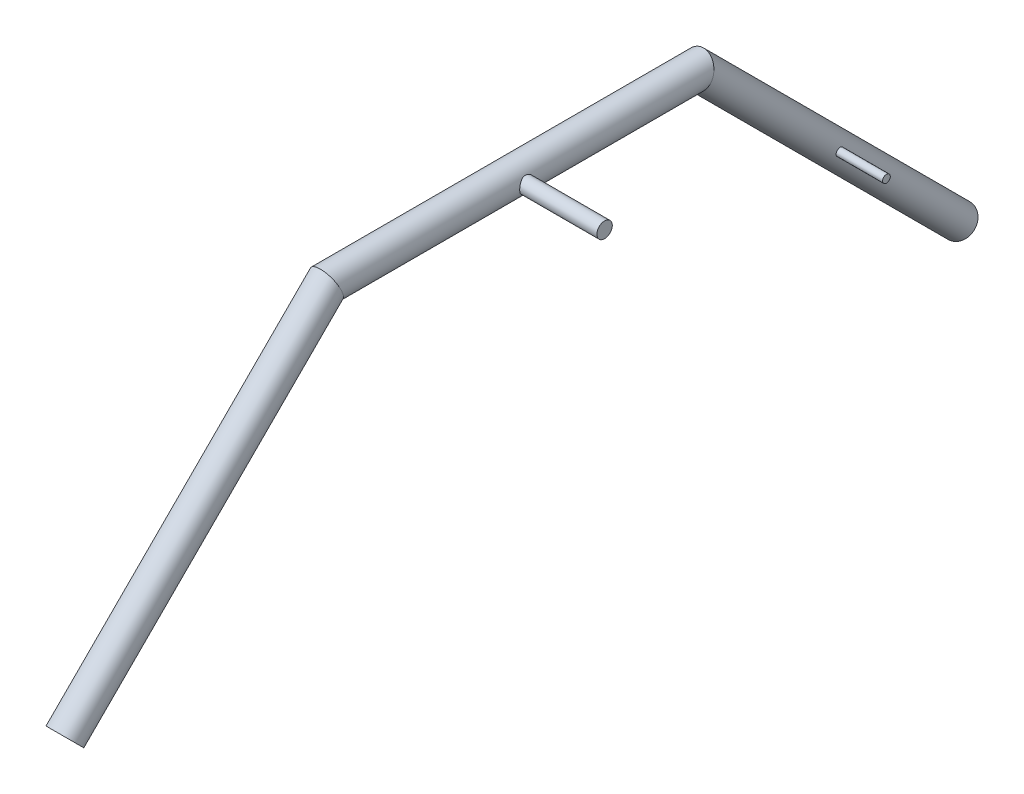
ISO-10303-21;
HEADER;
FILE_DESCRIPTION(('STEP AP214'),'2;1');
FILE_NAME('part.step','',(''),(''),'','','');
FILE_SCHEMA(('AUTOMOTIVE_DESIGN { 1 0 10303 214 1 1 1 1 }'));
ENDSEC;
DATA;
#1=APPLICATION_CONTEXT('core data for automotive mechanical design processes');
#2=APPLICATION_PROTOCOL_DEFINITION('international standard','automotive_design',2000,#1);
#3=PRODUCT_CONTEXT('',#1,'mechanical');
#4=PRODUCT('Part','Part','',(#3));
#5=PRODUCT_RELATED_PRODUCT_CATEGORY('part','',(#4));
#6=PRODUCT_DEFINITION_FORMATION('','',#4);
#7=PRODUCT_DEFINITION_CONTEXT('part definition',#1,'design');
#8=PRODUCT_DEFINITION('design','',#6,#7);
#9=PRODUCT_DEFINITION_SHAPE('','',#8);
#10=(LENGTH_UNIT() NAMED_UNIT(*) SI_UNIT(.MILLI.,.METRE.));
#11=(NAMED_UNIT(*) PLANE_ANGLE_UNIT() SI_UNIT($,.RADIAN.));
#12=(NAMED_UNIT(*) SI_UNIT($,.STERADIAN.) SOLID_ANGLE_UNIT());
#13=UNCERTAINTY_MEASURE_WITH_UNIT(LENGTH_MEASURE(1.E-05),#10,'distance_accuracy_value','');
#14=(GEOMETRIC_REPRESENTATION_CONTEXT(3) GLOBAL_UNCERTAINTY_ASSIGNED_CONTEXT((#13)) GLOBAL_UNIT_ASSIGNED_CONTEXT((#10,
#11,#12)) REPRESENTATION_CONTEXT('',''));
#15=CARTESIAN_POINT('',(0.,0.,0.));
#16=DIRECTION('',(0.,0.,1.));
#17=DIRECTION('',(1.,0.,0.));
#18=AXIS2_PLACEMENT_3D('',#15,#16,#17);
#19=CARTESIAN_POINT('',(0.,2.67264190432998,-267.981439124835));
#20=DIRECTION('',(0.,-0.707106781186549,-0.707106781186546));
#21=DIRECTION('',(0.,0.707106781186546,-0.707106781186549));
#22=AXIS2_PLACEMENT_3D('',#19,#20,#21);
#23=CYLINDRICAL_SURFACE('',#22,12.7);
#24=CARTESIAN_POINT('',(0.,-1.4897870406127,-272.143868069778));
#25=DIRECTION('',(0.,-0.382683432365091,-0.923879532511286));
#26=DIRECTION('',(0.,0.923879532511287,-0.382683432365091));
#27=AXIS2_PLACEMENT_3D('',#24,#25,#26);
#28=ELLIPSE('',#27,13.7463809437134,12.7);
#29=CARTESIAN_POINT('',(0.,11.2102129593873,-277.404380311916));
#30=VERTEX_POINT('',#29);
#31=EDGE_CURVE('E152',#30,#30,#28,.T.);
#32=ORIENTED_EDGE('',*,*,#31,.T.);
#33=EDGE_LOOP('',(#32));
#34=FACE_BOUND('',#33,.T.);
#35=CARTESIAN_POINT('',(0.,-217.015933946273,-487.670014975437));
#36=DIRECTION('',(0.,0.707106781186548,0.707106781186547));
#37=DIRECTION('',(0.,-0.707106781186547,0.707106781186548));
#38=AXIS2_PLACEMENT_3D('',#35,#36,#37);
#39=CIRCLE('',#38,12.7);
#40=CARTESIAN_POINT('',(0.,-225.996190067342,-478.689758854368));
#41=VERTEX_POINT('',#40);
#42=EDGE_CURVE('E156',#41,#41,#39,.T.);
#43=ORIENTED_EDGE('',*,*,#42,.T.);
#44=EDGE_LOOP('',(#43));
#45=FACE_BOUND('',#44,.T.);
#46=CARTESIAN_POINT('',(12.4999874999937,-106.435677825203,-373.914758854368));
#47=CARTESIAN_POINT('',(12.4774308159133,-106.613296229953,-373.914762703981));
#48=CARTESIAN_POINT('',(12.4548054258045,-106.790962337773,-373.929695563508));
#49=CARTESIAN_POINT('',(12.4119302847377,-107.141651066059,-373.989132726358));
#50=CARTESIAN_POINT('',(12.3916817169799,-107.314671341018,-374.033651685024));
#51=CARTESIAN_POINT('',(12.3558794506273,-107.651415581168,-374.151318426076));
#52=CARTESIAN_POINT('',(12.3403299572241,-107.815131113833,-374.224491717537));
#53=CARTESIAN_POINT('',(12.3158274167364,-108.128263167086,-374.397591451691));
#54=CARTESIAN_POINT('',(12.3068724243659,-108.277683893119,-374.497509993039));
#55=CARTESIAN_POINT('',(12.2967739271214,-108.554804130688,-374.718949794456));
#56=CARTESIAN_POINT('',(12.295472955332,-108.682888423618,-374.839982425864));
#57=CARTESIAN_POINT('',(12.3004186796713,-108.917229424737,-375.101456935852));
#58=CARTESIAN_POINT('',(12.3066650587202,-109.023487049691,-375.241897998824));
#59=CARTESIAN_POINT('',(12.3258140320083,-109.209891079952,-375.535970025358));
#60=CARTESIAN_POINT('',(12.3386230318437,-109.290379447298,-375.689390849644));
#61=CARTESIAN_POINT('',(12.3693832914651,-109.425261458215,-376.00681659668));
#62=CARTESIAN_POINT('',(12.3873351935626,-109.479651840064,-376.17082283949));
#63=CARTESIAN_POINT('',(12.4268424599308,-109.562001097659,-376.508713153742));
#64=CARTESIAN_POINT('',(12.4484671132642,-109.589365406622,-376.682733899038));
#65=CARTESIAN_POINT('',(12.4926700171693,-109.615016217514,-377.032798875869));
#66=CARTESIAN_POINT('',(12.5152484170445,-109.613298149812,-377.208843421055));
#67=CARTESIAN_POINT('',(12.5594573751072,-109.580413591236,-377.562561263728));
#68=CARTESIAN_POINT('',(12.5810530457171,-109.548553902453,-377.740175138209));
#69=CARTESIAN_POINT('',(12.6202947846351,-109.45508401895,-378.087861345052));
#70=CARTESIAN_POINT('',(12.6379411326156,-109.393475931848,-378.257934210748));
#71=CARTESIAN_POINT('',(12.6671416924897,-109.242786527527,-378.583979551051));
#72=CARTESIAN_POINT('',(12.6787542031537,-109.153981815589,-378.740074419834));
#73=CARTESIAN_POINT('',(12.6948273186598,-108.951137141524,-379.035305029085));
#74=CARTESIAN_POINT('',(12.6992892833412,-108.837101982238,-379.174443989455));
#75=CARTESIAN_POINT('',(12.7005362633086,-108.590537816145,-379.428058838528));
#76=CARTESIAN_POINT('',(12.6975236096849,-108.458585666366,-379.543095284858));
#77=CARTESIAN_POINT('',(12.6845760501251,-108.177825166994,-379.749822415017));
#78=CARTESIAN_POINT('',(12.6746412443862,-108.029017061416,-379.841513436742));
#79=CARTESIAN_POINT('',(12.6489601757792,-107.719275650268,-379.99889937427));
#80=CARTESIAN_POINT('',(12.633230961485,-107.558379006707,-380.064669392664));
#81=CARTESIAN_POINT('',(12.5976113919512,-107.228445854147,-380.169059883819));
#82=CARTESIAN_POINT('',(12.5777204187355,-107.05940813916,-380.20767632085));
#83=CARTESIAN_POINT('',(12.5353085283845,-106.713272917693,-380.257549872937));
#84=CARTESIAN_POINT('',(12.5127341952052,-106.536079589449,-380.268097089658));
#85=CARTESIAN_POINT('',(12.4678183886641,-106.182358861708,-380.259579118344));
#86=CARTESIAN_POINT('',(12.4454769459992,-106.005831551907,-380.240510075107));
#87=CARTESIAN_POINT('',(12.4031491923455,-105.655222239522,-380.172600304416));
#88=CARTESIAN_POINT('',(12.3832075966594,-105.48122803804,-380.123275674554));
#89=CARTESIAN_POINT('',(12.3484787951857,-105.143683592932,-379.995601365909));
#90=CARTESIAN_POINT('',(12.3336908089169,-104.980131770943,-379.917256085829));
#91=CARTESIAN_POINT('',(12.3113018784739,-104.671249752711,-379.735311759407));
#92=CARTESIAN_POINT('',(12.3035736050016,-104.525639477378,-379.632204306581));
#93=CARTESIAN_POINT('',(12.295796454121,-104.253624982652,-379.402958538851));
#94=CARTESIAN_POINT('',(12.2957462558343,-104.1272174635,-379.276824189059));
#95=CARTESIAN_POINT('',(12.3032294868332,-103.900318708096,-379.008778351293));
#96=CARTESIAN_POINT('',(12.3105706862351,-103.799251682174,-378.867347920799));
#97=CARTESIAN_POINT('',(12.3316825899819,-103.62166991453,-378.570277924103));
#98=CARTESIAN_POINT('',(12.3454536767203,-103.545156633506,-378.414637513259));
#99=CARTESIAN_POINT('',(12.377992615157,-103.418048274969,-378.09216548432));
#100=CARTESIAN_POINT('',(12.3967996657081,-103.367666042832,-377.925254104373));
#101=CARTESIAN_POINT('',(12.4372825765815,-103.294858302098,-377.585771705754));
#102=CARTESIAN_POINT('',(12.4589589395769,-103.272437699271,-377.413199699394));
#103=CARTESIAN_POINT('',(12.5035033653468,-103.255794110323,-377.061791218355));
#104=CARTESIAN_POINT('',(12.5263877748196,-103.262399132962,-376.882917132572));
#105=CARTESIAN_POINT('',(12.5702249663172,-103.305574771089,-376.528565056288));
#106=CARTESIAN_POINT('',(12.591177659424,-103.342146765209,-376.353087222413));
#107=CARTESIAN_POINT('',(12.6289432819481,-103.444731990364,-376.009388439358));
#108=CARTESIAN_POINT('',(12.6457326731422,-103.51090694344,-375.841212996652));
#109=CARTESIAN_POINT('',(12.6731107001936,-103.67106451604,-375.518126076959));
#110=CARTESIAN_POINT('',(12.6837005802602,-103.765041550129,-375.36321194383));
#111=CARTESIAN_POINT('',(12.6972882129736,-103.975487281581,-375.075031091473));
#112=CARTESIAN_POINT('',(12.7004683543248,-104.091338013789,-374.941321576355));
#113=CARTESIAN_POINT('',(12.6994193845116,-104.343605866953,-374.694986847074));
#114=CARTESIAN_POINT('',(12.6951903348188,-104.480022817271,-374.582361457992));
#115=CARTESIAN_POINT('',(12.6799229963267,-104.766988390637,-374.383075788012));
#116=CARTESIAN_POINT('',(12.6689965737807,-104.91727108577,-374.296022995164));
#117=CARTESIAN_POINT('',(12.6415986314408,-105.229529295862,-374.147703696041));
#118=CARTESIAN_POINT('',(12.6251291195718,-105.391500560096,-374.086427870393));
#119=CARTESIAN_POINT('',(12.590906834219,-105.699917140956,-373.997609737854));
#120=CARTESIAN_POINT('',(12.573643371503,-105.845427584718,-373.966583260285));
#121=CARTESIAN_POINT('',(12.5375984836211,-106.139173393799,-373.92515533715));
#122=CARTESIAN_POINT('',(12.5188169298521,-106.287408989151,-373.914755640863));
#123=CARTESIAN_POINT('',(12.4999874999937,-106.435677825203,-373.914758854368));
#124=B_SPLINE_CURVE_WITH_KNOTS('',3,(#46,#47,#48,#49,#50,#51,#52,#53,#54,#55,#56,#57,#58,#59,
#60,#61,#62,#63,#64,#65,#66,#67,#68,#69,#70,#71,#72,#73,#74,#75,#76,#77,#78,#79,#80,#81,#82,#83,
#84,#85,#86,#87,#88,#89,#90,#91,#92,#93,#94,#95,#96,#97,#98,#99,#100,#101,#102,#103,#104,#105,
#106,#107,#108,#109,#110,#111,#112,#113,#114,#115,#116,#117,#118,#119,#120,#121,#122,#123),
.UNSPECIFIED.,.T.,.F.,(4,2,2,2,2,2,2,2,2,2,2,2,2,2,2,2,2,2,2,2,2,2,2,2,2,2,2,2,2,2,2,2,2,2,2,2,
2,2,4),(0.,0.536611406915483,1.07348882027391,1.6108452709636,2.14804314541806,2.67414944959575,
3.20023365171696,3.71901559368892,4.23786235606629,4.76788501544009,5.29799095651773,
5.84059245201541,6.38315551087765,6.92037400977335,7.45749033218708,7.98022684141273,
8.50295578425222,9.02415885632173,9.54543937639686,10.0797835860516,10.6141973580594,
11.1573897372383,11.7004998176269,12.2336089588465,12.7666263878746,13.286130616937,
13.8056657455005,14.3293686945235,14.853163512467,15.3919960299147,15.9308533377725,
16.4726910908065,17.0144200625224,17.5426668407671,18.07090923634,18.5905601356185,
19.1100229991452,19.5579270453165,20.0058690749023),.UNSPECIFIED.);
#125=CARTESIAN_POINT('',(12.4999874999937,-106.435677825203,-373.914758854368));
#126=VERTEX_POINT('',#125);
#127=EDGE_CURVE('E11',#126,#126,#124,.T.);
#128=ORIENTED_EDGE('',*,*,#127,.F.);
#129=EDGE_LOOP('',(#128));
#130=FACE_BOUND('',#129,.T.);
#131=ADVANCED_FACE('F49',(#34,#45,#130),#23,.T.);
#132=CARTESIAN_POINT('',(0.,1.64971233762404,-269.004368691541));
#133=DIRECTION('',(0.,-0.707106781186549,-0.707106781186546));
#134=DIRECTION('',(0.,0.707106781186546,-0.707106781186549));
#135=AXIS2_PLACEMENT_3D('',#132,#133,#134);
#136=CYLINDRICAL_SURFACE('',#135,9.525);
#137=CARTESIAN_POINT('',(0.,-1.48978704061267,-272.143868069778));
#138=DIRECTION('',(0.,-0.382683432365091,-0.923879532511287));
#139=DIRECTION('',(0.,0.923879532511287,-0.382683432365091));
#140=AXIS2_PLACEMENT_3D('',#137,#138,#139);
#141=ELLIPSE('',#140,10.3097857077851,9.525);
#142=CARTESIAN_POINT('',(0.,8.03521295938733,-276.089252251382));
#143=VERTEX_POINT('',#142);
#144=EDGE_CURVE('E170',#143,#143,#141,.T.);
#145=ORIENTED_EDGE('',*,*,#144,.F.);
#146=EDGE_LOOP('',(#145));
#147=FACE_BOUND('',#146,.T.);
#148=CARTESIAN_POINT('',(0.,-217.015933946273,-487.670014975437));
#149=DIRECTION('',(0.,0.707106781186548,0.707106781186547));
#150=DIRECTION('',(0.,-0.707106781186547,0.707106781186548));
#151=AXIS2_PLACEMENT_3D('',#148,#149,#150);
#152=CIRCLE('',#151,9.525);
#153=CARTESIAN_POINT('',(0.,-223.751126037075,-480.934822884635));
#154=VERTEX_POINT('',#153);
#155=EDGE_CURVE('E119',#154,#154,#152,.T.);
#156=ORIENTED_EDGE('',*,*,#155,.F.);
#157=EDGE_LOOP('',(#156));
#158=FACE_BOUND('',#157,.T.);
#159=CARTESIAN_POINT('',(9.2566361330669,-106.435677825203,-373.914758854368));
#160=CARTESIAN_POINT('',(9.22625369415634,-106.61284378059,-373.914759305285));
#161=CARTESIAN_POINT('',(9.19572033423968,-106.789988041981,-373.929605975013));
#162=CARTESIAN_POINT('',(9.13769468420173,-107.139819904389,-373.988747406076));
#163=CARTESIAN_POINT('',(9.110202236732,-107.312507735644,-374.033040642901));
#164=CARTESIAN_POINT('',(9.06140624930749,-107.649197160547,-374.150400005933));
#165=CARTESIAN_POINT('',(9.04011536853919,-107.81318043571,-374.223524278751));
#166=CARTESIAN_POINT('',(9.00650350010365,-108.127143935009,-374.396863011019));
#167=CARTESIAN_POINT('',(8.9941791164519,-108.277129441899,-374.497067194442));
#168=CARTESIAN_POINT('',(8.98041886357656,-108.552983760381,-374.717494942393));
#169=CARTESIAN_POINT('',(8.97859172701316,-108.679546391399,-374.836826096324));
#170=CARTESIAN_POINT('',(8.98501157251472,-108.911380950948,-375.094381001645));
#171=CARTESIAN_POINT('',(8.99325769300374,-109.01665469944,-375.232603136373));
#172=CARTESIAN_POINT('',(9.01843466405963,-109.200572690618,-375.519937145604));
#173=CARTESIAN_POINT('',(9.03513585204407,-109.279834150475,-375.668675845768));
#174=CARTESIAN_POINT('',(9.07517195787649,-109.413655084985,-375.976032102128));
#175=CARTESIAN_POINT('',(9.09850820415607,-109.468209607286,-376.134651631634));
#176=CARTESIAN_POINT('',(9.15031653545138,-109.553255768015,-376.464140735586));
#177=CARTESIAN_POINT('',(9.1789530281446,-109.582729351716,-376.635246813805));
#178=CARTESIAN_POINT('',(9.23763706287566,-109.613484082108,-376.979758691349));
#179=CARTESIAN_POINT('',(9.26768500540163,-109.614757178108,-377.153165133248));
#180=CARTESIAN_POINT('',(9.32738328170894,-109.588482929504,-377.505721902996));
#181=CARTESIAN_POINT('',(9.35695918831099,-109.559676866828,-377.68479311411));
#182=CARTESIAN_POINT('',(9.41100757487288,-109.471751060213,-378.036155601749));
#183=CARTESIAN_POINT('',(9.43548062122286,-109.41263468308,-378.208447629002));
#184=CARTESIAN_POINT('',(9.4762346909668,-109.266492924834,-378.538616204564));
#185=CARTESIAN_POINT('',(9.49263658046103,-109.179913413465,-378.696674517982));
#186=CARTESIAN_POINT('',(9.51592728965883,-108.980866005526,-378.996316716221));
#187=CARTESIAN_POINT('',(9.52281941077462,-108.868407109073,-379.137906302687));
#188=CARTESIAN_POINT('',(9.52621404080112,-108.626843590776,-379.393871083991));
#189=CARTESIAN_POINT('',(9.52318768499377,-108.498764292014,-379.50920979264));
#190=CARTESIAN_POINT('',(9.50810220302706,-108.226002959164,-379.717457511193));
#191=CARTESIAN_POINT('',(9.49604339598474,-108.081321511784,-379.810367313357));
#192=CARTESIAN_POINT('',(9.46429029941504,-107.78078912834,-379.970747151693));
#193=CARTESIAN_POINT('',(9.44465727857003,-107.625035797494,-380.038412963128));
#194=CARTESIAN_POINT('',(9.39971630082359,-107.305495122311,-380.147958932001));
#195=CARTESIAN_POINT('',(9.37440714306365,-107.141706083655,-380.189833625969));
#196=CARTESIAN_POINT('',(9.31944891535626,-106.803212182266,-380.248279117799));
#197=CARTESIAN_POINT('',(9.28966353110439,-106.628336156844,-380.263730295827));
#198=CARTESIAN_POINT('',(9.2296853964353,-106.278458578545,-380.265688520709));
#199=CARTESIAN_POINT('',(9.19949253351738,-106.103457004177,-380.252187404676));
#200=CARTESIAN_POINT('',(9.14094922313878,-105.751741852399,-380.195500635445));
#201=CARTESIAN_POINT('',(9.11269506755115,-105.575169101156,-380.151330594112));
#202=CARTESIAN_POINT('',(9.06262096386527,-105.231354061251,-380.033099004666));
#203=CARTESIAN_POINT('',(9.04079941147191,-105.064109454594,-379.959044920583));
#204=CARTESIAN_POINT('',(9.00691150550902,-104.748456667348,-379.785212852438));
#205=CARTESIAN_POINT('',(8.99459459600127,-104.59965832921,-379.686194069437));
#206=CARTESIAN_POINT('',(8.98038798575557,-104.320516936098,-379.464306799775));
#207=CARTESIAN_POINT('',(8.97849456371158,-104.190167310914,-379.341446840909));
#208=CARTESIAN_POINT('',(8.98520921048567,-103.957943945014,-379.082306598006));
#209=CARTESIAN_POINT('',(8.99330663739838,-103.854986919848,-378.946980414889));
#210=CARTESIAN_POINT('',(9.01814885463917,-103.672240980367,-378.662230952276));
#211=CARTESIAN_POINT('',(9.03489440701275,-103.592454108699,-378.512806431428));
#212=CARTESIAN_POINT('',(9.07526055630374,-103.457278649707,-378.202694142633));
#213=CARTESIAN_POINT('',(9.09893777673245,-103.402100851278,-378.041922234196));
#214=CARTESIAN_POINT('',(9.15052321023592,-103.318111823733,-377.714281906877));
#215=CARTESIAN_POINT('',(9.17843260141573,-103.289307952063,-377.547411800294));
#216=CARTESIAN_POINT('',(9.23712924641286,-103.257725373884,-377.202653105114));
#217=CARTESIAN_POINT('',(9.26799067469422,-103.25638472164,-377.024644278913));
#218=CARTESIAN_POINT('',(9.32791319370628,-103.28346661224,-376.670566614777));
#219=CARTESIAN_POINT('',(9.35697401890834,-103.311893533792,-376.4944980661));
#220=CARTESIAN_POINT('',(9.41063805834846,-103.398812636844,-376.145894307926));
#221=CARTESIAN_POINT('',(9.43515626572202,-103.457812137323,-375.973471500914));
#222=CARTESIAN_POINT('',(9.47631220734737,-103.604890141072,-375.640496360179));
#223=CARTESIAN_POINT('',(9.49295247714385,-103.692959272659,-375.479940221181));
#224=CARTESIAN_POINT('',(9.51593377173127,-103.891719124677,-375.181965079926));
#225=CARTESIAN_POINT('',(9.52266102222905,-104.001361157316,-375.043876473016));
#226=CARTESIAN_POINT('',(9.52631007171409,-104.242049057937,-374.787696772458));
#227=CARTESIAN_POINT('',(9.52323405736289,-104.373090146579,-374.669601225459));
#228=CARTESIAN_POINT('',(9.50789631937358,-104.647746071033,-374.460556665555));
#229=CARTESIAN_POINT('',(9.49595034227166,-104.790782198237,-374.368821440157));
#230=CARTESIAN_POINT('',(9.46447276281759,-105.088971496396,-374.209551944207));
#231=CARTESIAN_POINT('',(9.44493984209636,-105.244126769526,-374.142021883665));
#232=CARTESIAN_POINT('',(9.39921908273319,-105.569585090413,-374.030112081064));
#233=CARTESIAN_POINT('',(9.37277171898518,-105.740255502865,-373.986908512978));
#234=CARTESIAN_POINT('',(9.31647797763818,-106.085849440986,-373.92922744373));
#235=CARTESIAN_POINT('',(9.28663060096233,-106.260774204837,-373.914758409209));
#236=CARTESIAN_POINT('',(9.2566361330669,-106.435677825203,-373.914758854368));
#237=B_SPLINE_CURVE_WITH_KNOTS('',3,(#159,#160,#161,#162,#163,#164,#165,#166,#167,#168,#169,
#170,#171,#172,#173,#174,#175,#176,#177,#178,#179,#180,#181,#182,#183,#184,#185,#186,#187,#188,
#189,#190,#191,#192,#193,#194,#195,#196,#197,#198,#199,#200,#201,#202,#203,#204,#205,#206,#207,
#208,#209,#210,#211,#212,#213,#214,#215,#216,#217,#218,#219,#220,#221,#222,#223,#224,#225,#226,
#227,#228,#229,#230,#231,#232,#233,#234,#235,#236),.UNSPECIFIED.,.T.,.F.,(4,2,2,2,2,2,2,2,2,2,2,
2,2,2,2,2,2,2,2,2,2,2,2,2,2,2,2,2,2,2,2,2,2,2,2,2,2,2,4),(0.,0.538651476051014,1.07727506716325,
1.61699056045342,2.15650153452772,2.67576572854465,3.19498551247615,3.70080329366502,
4.20672241805657,4.73231207509727,5.2580517758203,5.80670876214739,6.35530481803369,
6.89541465249098,7.43533693514239,7.94999103060345,8.46462694416151,8.97518436003212,
9.48584989284192,10.0176617174191,10.549623502155,11.0995004252561,11.6492400924688,
12.1839396112628,12.7184482237352,13.2267340504142,13.7350646732784,14.2476694907144,
14.76041726427,15.2999490983347,15.839560306835,16.3884269747644,16.9371168675341,
17.463805293109,17.9903762467274,18.4990507072891,19.0078135988387,19.5394301034358,
20.071203225824),.UNSPECIFIED.);
#238=CARTESIAN_POINT('',(9.2566361330669,-106.435677825203,-373.914758854368));
#239=VERTEX_POINT('',#238);
#240=EDGE_CURVE('E53',#239,#239,#237,.T.);
#241=ORIENTED_EDGE('',*,*,#240,.T.);
#242=EDGE_LOOP('',(#241));
#243=FACE_BOUND('',#242,.T.);
#244=ADVANCED_FACE('F105',(#147,#158,#243),#136,.F.);
#245=CARTESIAN_POINT('',(0.,-1.4897870406127,38.5426953965743));
#246=DIRECTION('',(0.,0.,-1.));
#247=DIRECTION('',(-1.,0.,0.));
#248=AXIS2_PLACEMENT_3D('',#245,#246,#247);
#249=CYLINDRICAL_SURFACE('',#248,12.7);
#250=CARTESIAN_POINT('',(0.,-1.4897870406127,32.6561319302221));
#251=DIRECTION('',(0.,0.382683432365091,-0.923879532511286));
#252=DIRECTION('',(0.,0.923879532511286,0.382683432365091));
#253=AXIS2_PLACEMENT_3D('',#250,#251,#252);
#254=ELLIPSE('',#253,13.7463809437134,12.7);
#255=CARTESIAN_POINT('',(0.,11.2102129593873,37.9166441723604));
#256=VERTEX_POINT('',#255);
#257=EDGE_CURVE('E67',#256,#256,#254,.T.);
#258=ORIENTED_EDGE('',*,*,#257,.T.);
#259=EDGE_LOOP('',(#258));
#260=FACE_BOUND('',#259,.T.);
#261=ORIENTED_EDGE('',*,*,#31,.F.);
#262=EDGE_LOOP('',(#261));
#263=FACE_BOUND('',#262,.T.);
#264=CARTESIAN_POINT('',(12.7,-1.4897870406127,-113.393868069778));
#265=CARTESIAN_POINT('',(12.6999994891774,-1.65677791980761,-113.393868627602));
#266=CARTESIAN_POINT('',(12.6966986728259,-1.82378049081133,-113.400462898579));
#267=CARTESIAN_POINT('',(12.6835786203218,-2.15655556725274,-113.42676474111));
#268=CARTESIAN_POINT('',(12.6737565484519,-2.32232750583582,-113.44647801737));
#269=CARTESIAN_POINT('',(12.6478292478082,-2.65156171789673,-113.498821868467));
#270=CARTESIAN_POINT('',(12.6317150589571,-2.81502035168104,-113.531470864958));
#271=CARTESIAN_POINT('',(12.5936085062318,-3.13828052309058,-113.609324399755));
#272=CARTESIAN_POINT('',(12.5716137398496,-3.29808053695416,-113.654534070016));
#273=CARTESIAN_POINT('',(12.5223959142721,-3.61222884940147,-113.756806889449));
#274=CARTESIAN_POINT('',(12.4951959650805,-3.76659780219676,-113.813817731834));
#275=CARTESIAN_POINT('',(12.436150269919,-4.06972158298842,-113.939267791719));
#276=CARTESIAN_POINT('',(12.4043027843762,-4.2184742824637,-114.007711289855));
#277=CARTESIAN_POINT('',(12.302881193969,-4.65491516254916,-114.229276396264));
#278=CARTESIAN_POINT('',(12.2273713354024,-4.93313208018793,-114.398746428739));
#279=CARTESIAN_POINT('',(12.0622186773861,-5.47450500182983,-114.787810575792));
#280=CARTESIAN_POINT('',(11.9719972312188,-5.73573158675631,-115.009816827984));
#281=CARTESIAN_POINT('',(11.7893960148839,-6.21915257216465,-115.492719878581));
#282=CARTESIAN_POINT('',(11.6970146601478,-6.44131722841707,-115.753646036034));
#283=CARTESIAN_POINT('',(11.5603243398217,-6.74934102839498,-116.181043203069));
#284=CARTESIAN_POINT('',(11.5134721485475,-6.85084974552579,-116.335664176016));
#285=CARTESIAN_POINT('',(11.4233099497228,-7.04037072821734,-116.653920454303));
#286=CARTESIAN_POINT('',(11.3799984680683,-7.12838862390478,-116.817551960308));
#287=CARTESIAN_POINT('',(11.2984098057888,-7.2901451235037,-117.152920205373));
#288=CARTESIAN_POINT('',(11.2601322945723,-7.36388466525522,-117.324656411172));
#289=CARTESIAN_POINT('',(11.1900882100937,-7.49624492897789,-117.675051126578));
#290=CARTESIAN_POINT('',(11.1583177917589,-7.55487458477507,-117.85370547357));
#291=CARTESIAN_POINT('',(11.104259497995,-7.65325884822883,-118.205844278748));
#292=CARTESIAN_POINT('',(11.08151961136,-7.69392953173717,-118.379003087267));
#293=CARTESIAN_POINT('',(11.0438804844397,-7.76068645741718,-118.728957979682));
#294=CARTESIAN_POINT('',(11.0289809087597,-7.78677332346183,-118.905753907653));
#295=CARTESIAN_POINT('',(11.0076763086804,-7.82394237980647,-119.261277364542));
#296=CARTESIAN_POINT('',(11.0012640993806,-7.83503726159646,-119.440003130374));
#297=CARTESIAN_POINT('',(10.9972004886715,-7.84207814818819,-119.797844612084));
#298=CARTESIAN_POINT('',(10.9995482514047,-7.83802559832464,-119.976960289129));
#299=CARTESIAN_POINT('',(11.012090292946,-7.81623881197733,-120.312450371653));
#300=CARTESIAN_POINT('',(11.0213095833287,-7.80020403536759,-120.468975429648));
#301=CARTESIAN_POINT('',(11.046128374712,-7.7566583855275,-120.779958604436));
#302=CARTESIAN_POINT('',(11.0617299789813,-7.72914372908407,-120.934416022499));
#303=CARTESIAN_POINT('',(11.0988027904553,-7.66295577509789,-121.24017936648));
#304=CARTESIAN_POINT('',(11.120273227066,-7.62428394248658,-121.391485703337));
#305=CARTESIAN_POINT('',(11.1684190383084,-7.53618489638032,-121.690106711781));
#306=CARTESIAN_POINT('',(11.1950964580098,-7.48675345611197,-121.83741978902));
#307=CARTESIAN_POINT('',(11.2831376118079,-7.32046703973683,-122.278796796713));
#308=CARTESIAN_POINT('',(11.351625656313,-7.18711862051005,-122.565418631972));
#309=CARTESIAN_POINT('',(11.500071400071,-6.88118584643924,-123.113444919895));
#310=CARTESIAN_POINT('',(11.5800342452273,-6.7085838678192,-123.374837970208));
#311=CARTESIAN_POINT('',(11.7546812882032,-6.30352420368694,-123.900055500737));
#312=CARTESIAN_POINT('',(11.8499465086129,-6.06625199945793,-124.159985740129));
#313=CARTESIAN_POINT('',(12.0362854764244,-5.5509097911418,-124.63807147064));
#314=CARTESIAN_POINT('',(12.1273572049436,-5.27282040062726,-124.856206996919));
#315=CARTESIAN_POINT('',(12.255938857257,-4.82265347800967,-125.152089444295));
#316=CARTESIAN_POINT('',(12.2983050254296,-4.66314426671061,-125.2472279165));
#317=CARTESIAN_POINT('',(12.3782218301755,-4.33548475687708,-125.423574781022));
#318=CARTESIAN_POINT('',(12.4157746297482,-4.16733838757132,-125.504789435907));
#319=CARTESIAN_POINT('',(12.4849579292559,-3.82357464405201,-125.652414640885));
#320=CARTESIAN_POINT('',(12.5165907293456,-3.64796020416409,-125.718830942643));
#321=CARTESIAN_POINT('',(12.5729876360055,-3.29053512580538,-125.83608972976));
#322=CARTESIAN_POINT('',(12.5977525327026,-3.10872520280673,-125.886934006693));
#323=CARTESIAN_POINT('',(12.6378915597613,-2.755723395467,-125.968815029523));
#324=CARTESIAN_POINT('',(12.6538736459652,-2.58489947760057,-126.001143656087));
#325=CARTESIAN_POINT('',(12.6789562420375,-2.24067835946114,-126.051713658141));
#326=CARTESIAN_POINT('',(12.6880571262137,-2.06728129967925,-126.069955799878));
#327=CARTESIAN_POINT('',(12.6991158370576,-1.71941665198612,-126.092106793677));
#328=CARTESIAN_POINT('',(12.7010765197081,-1.54494952006627,-126.096021376571));
#329=CARTESIAN_POINT('',(12.6978059034872,-1.19635653319513,-126.089479461829));
#330=CARTESIAN_POINT('',(12.6925749229034,-1.02223066348186,-126.079023600198));
#331=CARTESIAN_POINT('',(12.6757555094506,-0.689277503868629,-126.045254438257));
#332=CARTESIAN_POINT('',(12.6646934781011,-0.530314153448554,-126.023004995776));
#333=CARTESIAN_POINT('',(12.6368459564446,-0.214958640091404,-125.966646907296));
#334=CARTESIAN_POINT('',(12.6200585231077,-0.0585673689527108,-125.932534235195));
#335=CARTESIAN_POINT('',(12.581159973299,0.250520728027685,-125.852820116819));
#336=CARTESIAN_POINT('',(12.5590505630802,0.403218720721145,-125.807222352506));
#337=CARTESIAN_POINT('',(12.5099971792976,0.704118660112634,-125.704953678719));
#338=CARTESIAN_POINT('',(12.4830513245292,0.852318831001327,-125.648278459746));
#339=CARTESIAN_POINT('',(12.4240951779885,1.1474715217762,-125.522605775806));
#340=CARTESIAN_POINT('',(12.3919635638501,1.29427118289351,-125.453306064681));
#341=CARTESIAN_POINT('',(12.32392525103,1.58148052651925,-125.3040866757));
#342=CARTESIAN_POINT('',(12.2880172735192,1.72188802116851,-125.224163397842));
#343=CARTESIAN_POINT('',(12.1757741292216,2.13248672384417,-124.969318956096));
#344=CARTESIAN_POINT('',(12.0948877082824,2.39220836067138,-124.77925699099));
#345=CARTESIAN_POINT('',(11.9194499483036,2.90301290089874,-124.342728225611));
#346=CARTESIAN_POINT('',(11.8243367236915,3.1507428631143,-124.092555264645));
#347=CARTESIAN_POINT('',(11.6839772811164,3.48913691378379,-123.688957979926));
#348=CARTESIAN_POINT('',(11.6375432562751,3.59646676191905,-123.549591964638));
#349=CARTESIAN_POINT('',(11.5466734049483,3.79951204817738,-123.261934327099));
#350=CARTESIAN_POINT('',(11.5022378780468,3.89522574861524,-123.1136413744));
#351=CARTESIAN_POINT('',(11.4145838039713,4.07870685010253,-122.801439969167));
#352=CARTESIAN_POINT('',(11.3715304916549,4.16585845529205,-122.637122625727));
#353=CARTESIAN_POINT('',(11.290579644901,4.3257820531541,-122.300497535878));
#354=CARTESIAN_POINT('',(11.2526796279935,4.39856097720213,-122.128193690789));
#355=CARTESIAN_POINT('',(11.1834979926119,4.52891889153224,-121.776788905619));
#356=CARTESIAN_POINT('',(11.1522110654535,4.58651008309703,-121.597693554719));
#357=CARTESIAN_POINT('',(11.0975495796607,4.68577900994958,-121.233969731758));
#358=CARTESIAN_POINT('',(11.0741737959829,4.72745920918875,-121.049342121194));
#359=CARTESIAN_POINT('',(11.038221566145,4.79104599178573,-120.694129811253));
#360=CARTESIAN_POINT('',(11.0248238589961,4.81446663513222,-120.523898370593));
#361=CARTESIAN_POINT('',(11.0059068618669,4.84743482684167,-120.181662096087));
#362=CARTESIAN_POINT('',(11.0003870360907,4.85698331868744,-120.009657383646));
#363=CARTESIAN_POINT('',(10.9974561088362,4.86206051588589,-119.665436786344));
#364=CARTESIAN_POINT('',(11.0000420081603,4.85759440677727,-119.493221003152));
#365=CARTESIAN_POINT('',(11.0132073594892,4.83472372634817,-119.150034403732));
#366=CARTESIAN_POINT('',(11.023786484255,4.8163197256387,-118.979063536827));
#367=CARTESIAN_POINT('',(11.0511312712702,4.76826216657192,-118.656038379882));
#368=CARTESIAN_POINT('',(11.0672085028909,4.73985282658711,-118.503738751757));
#369=CARTESIAN_POINT('',(11.1050268373618,4.67218235062066,-118.20226770911));
#370=CARTESIAN_POINT('',(11.1267698205995,4.63291761161248,-118.053097350945));
#371=CARTESIAN_POINT('',(11.1995485940621,4.49941051488456,-117.61164373819));
#372=CARTESIAN_POINT('',(11.2581531108883,4.38942391610102,-117.325211050686));
#373=CARTESIAN_POINT('',(11.3937155944897,4.12243005274277,-116.755352064246));
#374=CARTESIAN_POINT('',(11.4716421113511,3.962760152483,-116.473420672326));
#375=CARTESIAN_POINT('',(11.635439817654,3.60388616889509,-115.938494996407));
#376=CARTESIAN_POINT('',(11.7213151279082,3.40466151762678,-115.685515875545));
#377=CARTESIAN_POINT('',(11.9038699110716,2.94375331211603,-115.18362981464));
#378=CARTESIAN_POINT('',(12.0005943076297,2.67742190853151,-114.938952637043));
#379=CARTESIAN_POINT('',(12.1383310810892,2.24834930257089,-114.607562019804));
#380=CARTESIAN_POINT('',(12.1830529217553,2.10025865671271,-114.502962977824));
#381=CARTESIAN_POINT('',(12.2688872478125,1.7949488582359,-114.306412892178));
#382=CARTESIAN_POINT('',(12.3100013738234,1.63773390953138,-114.214456088518));
#383=CARTESIAN_POINT('',(12.3878055405892,1.31382473336567,-114.043334961263));
#384=CARTESIAN_POINT('',(12.4244591999769,1.14706700677187,-113.964274249818));
#385=CARTESIAN_POINT('',(12.4919115290982,0.806356957012716,-113.82066178436));
#386=CARTESIAN_POINT('',(12.5227130740716,0.632408218327429,-113.756102902501));
#387=CARTESIAN_POINT('',(12.5775008101552,0.278938300784715,-113.642351329438));
#388=CARTESIAN_POINT('',(12.6015018553988,0.0994302321593499,-113.593125123776));
#389=CARTESIAN_POINT('',(12.642019952057,-0.263936499781345,-113.510532800744));
#390=CARTESIAN_POINT('',(12.6585415748002,-0.447792433229217,-113.477156995197));
#391=CARTESIAN_POINT('',(12.6806500718221,-0.774724011958794,-113.432635507854));
#392=CARTESIAN_POINT('',(12.6878936037074,-0.917238227961638,-113.41811016793));
#393=CARTESIAN_POINT('',(12.6975688534566,-1.20309442242374,-113.398726076059));
#394=CARTESIAN_POINT('',(12.7000004385074,-1.34643642362093,-113.393867590923));
#395=CARTESIAN_POINT('',(12.7,-1.4897870406127,-113.393868069778));
#396=B_SPLINE_CURVE_WITH_KNOTS('',3,(#264,#265,#266,#267,#268,#269,#270,#271,#272,#273,#274,
#275,#276,#277,#278,#279,#280,#281,#282,#283,#284,#285,#286,#287,#288,#289,#290,#291,#292,#293,
#294,#295,#296,#297,#298,#299,#300,#301,#302,#303,#304,#305,#306,#307,#308,#309,#310,#311,#312,
#313,#314,#315,#316,#317,#318,#319,#320,#321,#322,#323,#324,#325,#326,#327,#328,#329,#330,#331,
#332,#333,#334,#335,#336,#337,#338,#339,#340,#341,#342,#343,#344,#345,#346,#347,#348,#349,#350,
#351,#352,#353,#354,#355,#356,#357,#358,#359,#360,#361,#362,#363,#364,#365,#366,#367,#368,#369,
#370,#371,#372,#373,#374,#375,#376,#377,#378,#379,#380,#381,#382,#383,#384,#385,#386,#387,#388,
#389,#390,#391,#392,#393,#394,#395),.UNSPECIFIED.,.T.,.F.,(4,2,2,2,2,2,2,2,2,2,2,2,2,2,2,2,2,2,
2,2,2,2,2,2,2,2,2,2,2,2,2,2,2,2,2,2,2,2,2,2,2,2,2,2,2,2,2,2,2,2,2,2,2,2,2,2,2,2,2,2,2,2,2,2,2,
4),(0.,0.500831224205358,1.00188037372803,1.50364564290689,2.00561622220709,2.50540779268628,
3.0053869172507,4.00425210956755,5.06354639773445,6.12364383897771,6.69546056113471,
7.26703799333406,7.83857787007115,8.40977904053157,8.94696617231633,9.48413032231424,
10.020839449589,10.5574973665628,11.0297819407841,11.5022222802448,11.9746006167424,
12.447164856978,13.4133450583963,14.3799599077214,15.4691385823986,16.558836254714,
17.1296896955319,17.7002857039293,18.2706595507725,18.840967750957,19.3640345307036,
19.8870728558157,20.4099019497636,20.9327079051584,21.4148301207384,21.8971161172382,
22.3792476958437,22.8615672144633,23.3574791185916,23.8535595025871,24.845213267335,
25.9342484207188,26.4795520760264,27.0249372042285,27.5969396508644,28.1686655660688,
28.7399307681393,29.3111074690516,29.8274552059118,30.3437678229116,30.8598894217494,
31.3759898919437,31.8427315926275,32.3096283963947,33.2427989036526,34.2386648311406,
35.2350499582129,36.3525027406484,36.9121724680044,37.4715863502977,38.0352942497766,
38.5987244700202,39.1609143479984,39.7227601571806,40.1526787482413,40.5826092051903),.UNSPECIFIED.);
#397=CARTESIAN_POINT('',(12.7,-1.4897870406127,-113.393868069778));
#398=VERTEX_POINT('',#397);
#399=EDGE_CURVE('E62',#398,#398,#396,.T.);
#400=ORIENTED_EDGE('',*,*,#399,.F.);
#401=EDGE_LOOP('',(#400));
#402=FACE_BOUND('',#401,.T.);
#403=ADVANCED_FACE('F121',(#260,#263,#402),#249,.T.);
#404=CARTESIAN_POINT('',(0.,-1.48978704061267,37.0960545299863));
#405=DIRECTION('',(0.,0.,-1.));
#406=DIRECTION('',(-1.,0.,0.));
#407=AXIS2_PLACEMENT_3D('',#404,#405,#406);
#408=CYLINDRICAL_SURFACE('',#407,9.525);
#409=ORIENTED_EDGE('',*,*,#144,.T.);
#410=EDGE_LOOP('',(#409));
#411=FACE_BOUND('',#410,.T.);
#412=CARTESIAN_POINT('',(0.,-1.48978704061256,32.6561319302221));
#413=DIRECTION('',(0.,0.382683432365091,-0.923879532511287));
#414=DIRECTION('',(0.,0.923879532511287,0.382683432365091));
#415=AXIS2_PLACEMENT_3D('',#412,#413,#414);
#416=ELLIPSE('',#415,10.3097857077851,9.525);
#417=CARTESIAN_POINT('',(0.,8.03521295938744,36.6015161118259));
#418=VERTEX_POINT('',#417);
#419=EDGE_CURVE('E162',#418,#418,#416,.T.);
#420=ORIENTED_EDGE('',*,*,#419,.F.);
#421=EDGE_LOOP('',(#420));
#422=FACE_BOUND('',#421,.T.);
#423=CARTESIAN_POINT('',(9.52500000000001,-1.4897870406127,-113.393868069778));
#424=CARTESIAN_POINT('',(9.52499995302127,-1.64930922529285,-113.393868116678));
#425=CARTESIAN_POINT('',(9.52098401348312,-1.80883221666415,-113.399887291772));
#426=CARTESIAN_POINT('',(9.50502147249805,-2.12657409223065,-113.423869032869));
#427=CARTESIAN_POINT('',(9.49307482930957,-2.28479296955748,-113.441831661733));
#428=CARTESIAN_POINT('',(9.46153969282097,-2.59874758910036,-113.489435560633));
#429=CARTESIAN_POINT('',(9.44194822064128,-2.75448233870052,-113.519081383179));
#430=CARTESIAN_POINT('',(9.39559036683439,-3.06228048590965,-113.589625713896));
#431=CARTESIAN_POINT('',(9.36882389844983,-3.21434383910125,-113.630524358131));
#432=CARTESIAN_POINT('',(9.30886537420495,-3.51308617199159,-113.722815357228));
#433=CARTESIAN_POINT('',(9.2757059421349,-3.65978817181756,-113.774154503377));
#434=CARTESIAN_POINT('',(9.2035713113691,-3.94783217303828,-113.886866631401));
#435=CARTESIAN_POINT('',(9.1645938472794,-4.08917205955641,-113.948243522615));
#436=CARTESIAN_POINT('',(9.04008640647303,-4.50402258574737,-114.146486048555));
#437=CARTESIAN_POINT('',(8.94692755885441,-4.76862219208656,-114.297544537793));
#438=CARTESIAN_POINT('',(8.73846290686175,-5.29120746012685,-114.646915476657));
#439=CARTESIAN_POINT('',(8.62194858766981,-5.54672657395838,-114.84815002851));
#440=CARTESIAN_POINT('',(8.38142132332393,-6.02283653690501,-115.285331001584));
#441=CARTESIAN_POINT('',(8.25739778727135,-6.24337638777616,-115.52132715493));
#442=CARTESIAN_POINT('',(8.06347927572664,-6.56173796199019,-115.918602359765));
#443=CARTESIAN_POINT('',(7.99276165906505,-6.67215605585161,-116.06954997759));
#444=CARTESIAN_POINT('',(7.85423181855953,-6.87980175525613,-116.381517753631));
#445=CARTESIAN_POINT('',(7.78642025681812,-6.9770263656721,-116.542540186906));
#446=CARTESIAN_POINT('',(7.59098753954933,-7.24754365030399,-117.039668971679));
#447=CARTESIAN_POINT('',(7.47095386772018,-7.40032724740184,-117.39063937361));
#448=CARTESIAN_POINT('',(7.30173884021222,-7.60720858103283,-118.019018551067));
#449=CARTESIAN_POINT('',(7.24210690604665,-7.67706306488747,-118.288408303811));
#450=CARTESIAN_POINT('',(7.17443610973183,-7.75510524308877,-118.700845704673));
#451=CARTESIAN_POINT('',(7.15551189712762,-7.77665944849341,-118.839660113549));
#452=CARTESIAN_POINT('',(7.1255840953054,-7.81056299642999,-119.119284759294));
#453=CARTESIAN_POINT('',(7.11458054949506,-7.82291228851621,-119.260095007098));
#454=CARTESIAN_POINT('',(7.10093685388961,-7.83820605740571,-119.543217701081));
#455=CARTESIAN_POINT('',(7.09833152574747,-7.84111137694439,-119.685533953271));
#456=CARTESIAN_POINT('',(7.10169083317634,-7.83735497956311,-119.969937038923));
#457=CARTESIAN_POINT('',(7.10765549785802,-7.83069323014559,-120.112023871604));
#458=CARTESIAN_POINT('',(7.12790820220153,-7.80791818180331,-120.394914829016));
#459=CARTESIAN_POINT('',(7.14220075299526,-7.7917997602619,-120.5357182165));
#460=CARTESIAN_POINT('',(7.17852290817034,-7.75039243299932,-120.814979596537));
#461=CARTESIAN_POINT('',(7.20055576995174,-7.72509966623925,-120.953436575882));
#462=CARTESIAN_POINT('',(7.27478957681072,-7.63866607320999,-121.351731969154));
#463=CARTESIAN_POINT('',(7.33620201701265,-7.5658444005062,-121.607423262154));
#464=CARTESIAN_POINT('',(7.47743075866494,-7.39115778214636,-122.10301535485));
#465=CARTESIAN_POINT('',(7.55725311438592,-7.2892832795868,-122.34291092654));
#466=CARTESIAN_POINT('',(7.74586039676384,-7.03568875038075,-122.852250602729));
#467=CARTESIAN_POINT('',(7.85723391455877,-6.87804480236335,-123.117779629039));
#468=CARTESIAN_POINT('',(8.08646851184115,-6.52749939970247,-123.621794016285));
#469=CARTESIAN_POINT('',(8.20433746619289,-6.33455445952359,-123.860245427949));
#470=CARTESIAN_POINT('',(8.39189544489691,-5.99789459699153,-124.219821344461));
#471=CARTESIAN_POINT('',(8.46237649743462,-5.8644893271291,-124.350324467896));
#472=CARTESIAN_POINT('',(8.60065671785608,-5.58594052619248,-124.599684257906));
#473=CARTESIAN_POINT('',(8.66845667843422,-5.4408005038558,-124.718544382447));
#474=CARTESIAN_POINT('',(8.7996219217699,-5.13934790005115,-124.943732042199));
#475=CARTESIAN_POINT('',(8.86298939243476,-4.98304090880162,-125.05006577851));
#476=CARTESIAN_POINT('',(8.98365184167378,-4.65985791864928,-125.249243019022));
#477=CARTESIAN_POINT('',(9.04094848992311,-4.49298484604233,-125.342090235078));
#478=CARTESIAN_POINT('',(9.13738661743715,-4.18324340658336,-125.496396618687));
#479=CARTESIAN_POINT('',(9.17788544551756,-4.04208029265907,-125.560441075967));
#480=CARTESIAN_POINT('',(9.25313321006477,-3.7541369477202,-125.67846303454));
#481=CARTESIAN_POINT('',(9.28788331086878,-3.60735786158829,-125.732442574646));
#482=CARTESIAN_POINT('',(9.35089181550515,-3.30903750175028,-125.829706105766));
#483=CARTESIAN_POINT('',(9.37915430201628,-3.15749929162123,-125.872996824598));
#484=CARTESIAN_POINT('',(9.42858494827341,-2.85051403995657,-125.948374452535));
#485=CARTESIAN_POINT('',(9.44975299888663,-2.69506693833053,-125.980461189292));
#486=CARTESIAN_POINT('',(9.48456888164441,-2.38068351270774,-126.033090096963));
#487=CARTESIAN_POINT('',(9.49818341565516,-2.22173490092614,-126.053581158506));
#488=CARTESIAN_POINT('',(9.51741035483457,-1.90225761589235,-126.082487141627));
#489=CARTESIAN_POINT('',(9.52302274954712,-1.74172894057582,-126.090902047424));
#490=CARTESIAN_POINT('',(9.52610229035684,-1.42042447825188,-126.095521614299));
#491=CARTESIAN_POINT('',(9.52356977217138,-1.25964870170253,-126.091726778638));
#492=CARTESIAN_POINT('',(9.51042464732743,-0.939184424625408,-126.071988359065));
#493=CARTESIAN_POINT('',(9.49981238552947,-0.779495877985874,-126.056045293666));
#494=CARTESIAN_POINT('',(9.4718027732773,-0.473682198459496,-126.01380845069));
#495=CARTESIAN_POINT('',(9.45493707431771,-0.327395139882953,-125.988324486946));
#496=CARTESIAN_POINT('',(9.41480857349519,-0.0377575538528498,-125.927396236312));
#497=CARTESIAN_POINT('',(9.39154359951066,0.105591958718021,-125.891948567327));
#498=CARTESIAN_POINT('',(9.33908968905819,0.388431031950814,-125.811520190023));
#499=CARTESIAN_POINT('',(9.30990252412285,0.527921732770945,-125.766542332335));
#500=CARTESIAN_POINT('',(9.24615452254172,0.802405218616712,-125.667521825114));
#501=CARTESIAN_POINT('',(9.21159162148365,0.937396251376383,-125.613475692513));
#502=CARTESIAN_POINT('',(9.09628940016217,1.3506163102164,-125.431450953425));
#503=CARTESIAN_POINT('',(9.00716257089463,1.6200696720948,-125.288424795719));
#504=CARTESIAN_POINT('',(8.81384971588905,2.1319252609917,-124.96852574876));
#505=CARTESIAN_POINT('',(8.70965439960832,2.37431063452643,-124.791631956314));
#506=CARTESIAN_POINT('',(8.47581446020667,2.86583066768937,-124.37745259834));
#507=CARTESIAN_POINT('',(8.3447509597295,3.10997165179558,-124.13504052368));
#508=CARTESIAN_POINT('',(8.08261425005548,3.55639497814611,-123.61379892226));
#509=CARTESIAN_POINT('',(7.9515410962865,3.75864838894042,-123.334944440378));
#510=CARTESIAN_POINT('',(7.77027012491587,4.02007534760594,-122.904394815992));
#511=CARTESIAN_POINT('',(7.71474176600138,4.09738426015174,-122.765694765299));
#512=CARTESIAN_POINT('',(7.60792322109691,4.24198320330717,-122.481517245127));
#513=CARTESIAN_POINT('',(7.5566335387924,4.30927204398296,-122.336038973389));
#514=CARTESIAN_POINT('',(7.4599440456278,4.43313739453511,-122.038935896259));
#515=CARTESIAN_POINT('',(7.41453651392781,4.48972799257532,-121.887319498156));
#516=CARTESIAN_POINT('',(7.33120548567237,4.59160970275434,-121.578406981876));
#517=CARTESIAN_POINT('',(7.29327725021167,4.63690797458407,-121.421114535295));
#518=CARTESIAN_POINT('',(7.23250015831976,4.70846729314677,-121.130360055854));
#519=CARTESIAN_POINT('',(7.20816660455853,4.73668601156565,-120.997688600048));
#520=CARTESIAN_POINT('',(7.16642919594874,4.78467969495344,-120.729802980355));
#521=CARTESIAN_POINT('',(7.14902187990607,4.80445887770345,-120.594590121931));
#522=CARTESIAN_POINT('',(7.12177272282831,4.83527452613775,-120.322509025974));
#523=CARTESIAN_POINT('',(7.1119253418161,4.84631739404047,-120.185642075426));
#524=CARTESIAN_POINT('',(7.10016206836552,4.8594966329176,-119.911133097958));
#525=CARTESIAN_POINT('',(7.09824629168029,4.86163287390946,-119.773491059756));
#526=CARTESIAN_POINT('',(7.10242578322567,4.85695876359759,-119.49840396631));
#527=CARTESIAN_POINT('',(7.10852562465069,4.85014330503284,-119.360959068344));
#528=CARTESIAN_POINT('',(7.12849870958464,4.82767721589365,-119.087372489053));
#529=CARTESIAN_POINT('',(7.14237188936862,4.81202665774834,-118.951230797055));
#530=CARTESIAN_POINT('',(7.17737840896367,4.7721268682217,-118.681040810039));
#531=CARTESIAN_POINT('',(7.19851840065331,4.74786975793652,-118.546994551083));
#532=CARTESIAN_POINT('',(7.24732531577334,4.69109469490422,-118.281813102746));
#533=CARTESIAN_POINT('',(7.27499597014281,4.65857201925664,-118.150679624452));
#534=CARTESIAN_POINT('',(7.34411691812824,4.57595222521642,-117.857533768684));
#535=CARTESIAN_POINT('',(7.38727463760103,4.52348145286817,-117.696589931828));
#536=CARTESIAN_POINT('',(7.48081228796889,4.40670899653651,-117.381213232929));
#537=CARTESIAN_POINT('',(7.531194821228,4.34240304716916,-117.226782743032));
#538=CARTESIAN_POINT('',(7.63741566100001,4.20259470839168,-116.92482708684));
#539=CARTESIAN_POINT('',(7.69325954935143,4.12708082211867,-116.777309218248));
#540=CARTESIAN_POINT('',(7.80864869446419,3.96553281180321,-116.489763034014));
#541=CARTESIAN_POINT('',(7.86819375566852,3.87949924335199,-116.349734323397));
#542=CARTESIAN_POINT('',(8.05228150665759,3.60293394289837,-115.936255426986));
#543=CARTESIAN_POINT('',(8.18031359367672,3.39640411916301,-115.674708188016));
#544=CARTESIAN_POINT('',(8.37035628725425,3.05770176880967,-115.308721978129));
#545=CARTESIAN_POINT('',(8.43339844653293,2.93992157643046,-115.19106712991));
#546=CARTESIAN_POINT('',(8.55762624300504,2.69488650186075,-114.964872826424));
#547=CARTESIAN_POINT('',(8.61881160088007,2.56763020402791,-114.856334738292));
#548=CARTESIAN_POINT('',(8.74664952542504,2.28501736979934,-114.634057297877));
#549=CARTESIAN_POINT('',(8.81281921736053,2.12825418087689,-114.521822638893));
#550=CARTESIAN_POINT('',(8.93924181678019,1.80352681879335,-114.311188212662));
#551=CARTESIAN_POINT('',(8.99949728550241,1.63556754764219,-114.212782448574));
#552=CARTESIAN_POINT('',(9.11233491255446,1.28943578715884,-114.031023525024));
#553=CARTESIAN_POINT('',(9.16492428514217,1.11127312269909,-113.947656195711));
#554=CARTESIAN_POINT('',(9.26084237436768,0.745848262571908,-113.797151135933));
#555=CARTESIAN_POINT('',(9.30417434247485,0.5585892902488,-113.730007706074));
#556=CARTESIAN_POINT('',(9.37168114342143,0.219066818148169,-113.62615062778));
#557=CARTESIAN_POINT('',(9.39797327715977,0.0682689330680034,-113.585990591986));
#558=CARTESIAN_POINT('',(9.44349657410066,-0.236879860696988,-113.516735004393));
#559=CARTESIAN_POINT('',(9.46272919616698,-0.391230028280559,-113.487637166523));
#560=CARTESIAN_POINT('',(9.49367827215344,-0.70231226298595,-113.440923677682));
#561=CARTESIAN_POINT('',(9.50539918929339,-0.859042858949776,-113.423301208306));
#562=CARTESIAN_POINT('',(9.52106022240963,-1.17377768797301,-113.39977316138));
#563=CARTESIAN_POINT('',(9.52500004653198,-1.33178196858272,-113.393868023324));
#564=CARTESIAN_POINT('',(9.52500000000001,-1.4897870406127,-113.393868069778));
#565=B_SPLINE_CURVE_WITH_KNOTS('',3,(#423,#424,#425,#426,#427,#428,#429,#430,#431,#432,#433,
#434,#435,#436,#437,#438,#439,#440,#441,#442,#443,#444,#445,#446,#447,#448,#449,#450,#451,#452,
#453,#454,#455,#456,#457,#458,#459,#460,#461,#462,#463,#464,#465,#466,#467,#468,#469,#470,#471,
#472,#473,#474,#475,#476,#477,#478,#479,#480,#481,#482,#483,#484,#485,#486,#487,#488,#489,#490,
#491,#492,#493,#494,#495,#496,#497,#498,#499,#500,#501,#502,#503,#504,#505,#506,#507,#508,#509,
#510,#511,#512,#513,#514,#515,#516,#517,#518,#519,#520,#521,#522,#523,#524,#525,#526,#527,#528,
#529,#530,#531,#532,#533,#534,#535,#536,#537,#538,#539,#540,#541,#542,#543,#544,#545,#546,#547,
#548,#549,#550,#551,#552,#553,#554,#555,#556,#557,#558,#559,#560,#561,#562,#563,#564),
.UNSPECIFIED.,.T.,.F.,(4,2,2,2,2,2,2,2,2,2,2,2,2,2,2,2,2,2,2,2,2,2,2,2,2,2,2,2,2,2,2,2,2,2,2,2,
2,2,2,2,2,2,2,2,2,2,2,2,2,2,2,2,2,2,2,2,2,2,2,2,2,2,2,2,2,2,2,2,2,2,4),(0.,0.47840538061794,
0.956813279239054,1.4354077804509,1.91400806890837,2.3902277496366,2.8666333442711,
3.81862625068162,4.85140247863723,5.88567087629456,6.48485332921755,7.08417157918498,
8.27951533243021,9.12972915875145,9.55449841242711,9.97926999395051,10.4058005617562,
10.8323325784106,11.259095858237,11.6860389509021,12.5013302126937,13.3168899738091,
14.2983393334806,15.2810059330147,15.8788611327681,16.47653822789,17.0739181926961,
17.6711334295995,18.1513005477461,18.631370294298,19.1111370979202,19.5909112813935,
20.0727839793195,20.5546573068918,21.0365107728437,21.5183436734241,21.9661749409647,
22.414158404953,22.8620080586,23.3100301238974,24.2594691600945,25.2094960927675,
26.3097517407433,27.4107648115876,27.9150410851496,28.4193771963737,28.9230444657225,
29.4263915772578,29.8393858100912,30.2521734005924,30.6646582077437,31.077149034642,
31.4898753043957,31.9025981907154,32.3156998849318,32.7290381560639,33.2523652916645,
33.7758814044031,34.2999382884879,34.8239675067413,35.8903398922336,36.4240224132792,
36.9577848221176,37.5684710444783,38.1788916227338,38.7887339977982,39.3983618250757,
39.8725796504944,40.3466994224999,40.8205372255695,41.2943928010534),.UNSPECIFIED.);
#566=CARTESIAN_POINT('',(9.52500000000001,-1.4897870406127,-113.393868069778));
#567=VERTEX_POINT('',#566);
#568=EDGE_CURVE('E109',#567,#567,#565,.T.);
#569=ORIENTED_EDGE('',*,*,#568,.T.);
#570=EDGE_LOOP('',(#569));
#571=FACE_BOUND('',#570,.T.);
#572=ADVANCED_FACE('F125',(#411,#422,#571),#408,.F.);
#573=CARTESIAN_POINT('',(0.,-217.015933946273,-487.670014975437));
#574=DIRECTION('',(0.,0.707106781186548,0.707106781186547));
#575=DIRECTION('',(0.,-0.707106781186547,0.707106781186548));
#576=AXIS2_PLACEMENT_3D('',#573,#574,#575);
#577=PLANE('',#576);
#578=ORIENTED_EDGE('',*,*,#155,.T.);
#579=EDGE_LOOP('',(#578));
#580=FACE_BOUND('',#579,.T.);
#581=ORIENTED_EDGE('',*,*,#42,.F.);
#582=EDGE_LOOP('',(#581));
#583=FACE_BOUND('',#582,.T.);
#584=ADVANCED_FACE('F51',(#580,#583),#577,.F.);
#585=CARTESIAN_POINT('',(0.,-217.015933946273,248.182278835881));
#586=DIRECTION('',(0.,-0.707106781186549,0.707106781186546));
#587=DIRECTION('',(0.,-0.707106781186546,-0.707106781186549));
#588=AXIS2_PLACEMENT_3D('',#585,#586,#587);
#589=PLANE('',#588);
#590=CARTESIAN_POINT('',(0.,-217.015933946273,248.182278835881));
#591=DIRECTION('',(0.,-0.707106781186549,0.707106781186546));
#592=DIRECTION('',(0.,-0.707106781186546,-0.707106781186549));
#593=AXIS2_PLACEMENT_3D('',#590,#591,#592);
#594=CIRCLE('',#593,9.525);
#595=CARTESIAN_POINT('',(0.,-223.751126037075,241.44708674508));
#596=VERTEX_POINT('',#595);
#597=EDGE_CURVE('E158',#596,#596,#594,.T.);
#598=ORIENTED_EDGE('',*,*,#597,.F.);
#599=EDGE_LOOP('',(#598));
#600=FACE_BOUND('',#599,.T.);
#601=CARTESIAN_POINT('',(0.,-217.015933946273,248.182278835881));
#602=DIRECTION('',(0.,-0.707106781186549,0.707106781186546));
#603=DIRECTION('',(0.,-0.707106781186546,-0.707106781186549));
#604=AXIS2_PLACEMENT_3D('',#601,#602,#603);
#605=CIRCLE('',#604,12.7);
#606=CARTESIAN_POINT('',(0.,-225.996190067342,239.202022714812));
#607=VERTEX_POINT('',#606);
#608=EDGE_CURVE('E159',#607,#607,#605,.T.);
#609=ORIENTED_EDGE('',*,*,#608,.T.);
#610=EDGE_LOOP('',(#609));
#611=FACE_BOUND('',#610,.T.);
#612=ADVANCED_FACE('F130',(#600,#611),#589,.T.);
#613=CARTESIAN_POINT('',(0.,-217.015933946273,248.182278835881));
#614=DIRECTION('',(0.,0.707106781186549,-0.707106781186546));
#615=DIRECTION('',(0.,0.707106781186546,0.707106781186549));
#616=AXIS2_PLACEMENT_3D('',#613,#614,#615);
#617=CYLINDRICAL_SURFACE('',#616,12.7);
#618=ORIENTED_EDGE('',*,*,#608,.F.);
#619=EDGE_LOOP('',(#618));
#620=FACE_BOUND('',#619,.T.);
#621=ORIENTED_EDGE('',*,*,#257,.F.);
#622=EDGE_LOOP('',(#621));
#623=FACE_BOUND('',#622,.T.);
#624=ADVANCED_FACE('F127',(#620,#623),#617,.T.);
#625=CARTESIAN_POINT('',(0.,-219.844361071018,251.010705960627));
#626=DIRECTION('',(0.,0.707106781186549,-0.707106781186546));
#627=DIRECTION('',(0.,0.707106781186546,0.707106781186549));
#628=AXIS2_PLACEMENT_3D('',#625,#626,#627);
#629=CYLINDRICAL_SURFACE('',#628,9.525);
#630=ORIENTED_EDGE('',*,*,#419,.T.);
#631=EDGE_LOOP('',(#630));
#632=FACE_BOUND('',#631,.T.);
#633=ORIENTED_EDGE('',*,*,#597,.T.);
#634=EDGE_LOOP('',(#633));
#635=FACE_BOUND('',#634,.T.);
#636=ADVANCED_FACE('F100',(#632,#635),#629,.F.);
#637=CARTESIAN_POINT('',(0.,-1.4897870406127,-119.743868069778));
#638=DIRECTION('',(1.,0.,0.));
#639=DIRECTION('',(0.,0.,-1.));
#640=AXIS2_PLACEMENT_3D('',#637,#638,#639);
#641=PLANE('',#640);
#642=CARTESIAN_POINT('',(0.,-1.4897870406127,-119.743868069778));
#643=DIRECTION('',(1.,0.,0.));
#644=DIRECTION('',(0.,0.,-1.));
#645=AXIS2_PLACEMENT_3D('',#642,#643,#644);
#646=CIRCLE('',#645,6.35);
#647=CARTESIAN_POINT('',(0.,-1.4897870406127,-126.093868069778));
#648=VERTEX_POINT('',#647);
#649=EDGE_CURVE('E118',#648,#648,#646,.T.);
#650=ORIENTED_EDGE('',*,*,#649,.F.);
#651=EDGE_LOOP('',(#650));
#652=FACE_BOUND('',#651,.T.);
#653=ADVANCED_FACE('F96',(#652),#641,.F.);
#654=CARTESIAN_POINT('',(76.2,-1.4897870406127,-119.743868069778));
#655=DIRECTION('',(-1.,0.,0.));
#656=DIRECTION('',(0.,0.,1.));
#657=AXIS2_PLACEMENT_3D('',#654,#655,#656);
#658=CYLINDRICAL_SURFACE('',#657,6.35);
#659=ORIENTED_EDGE('',*,*,#568,.F.);
#660=EDGE_LOOP('',(#659));
#661=FACE_BOUND('',#660,.T.);
#662=ORIENTED_EDGE('',*,*,#649,.T.);
#663=EDGE_LOOP('',(#662));
#664=FACE_BOUND('',#663,.T.);
#665=ADVANCED_FACE('F99',(#661,#664),#658,.T.);
#666=CARTESIAN_POINT('',(76.2,-1.4897870406127,-119.743868069778));
#667=DIRECTION('',(1.,0.,0.));
#668=DIRECTION('',(0.,0.,-1.));
#669=AXIS2_PLACEMENT_3D('',#666,#667,#668);
#670=CIRCLE('',#669,6.35);
#671=CARTESIAN_POINT('',(76.2,-1.4897870406127,-126.093868069778));
#672=VERTEX_POINT('',#671);
#673=EDGE_CURVE('E77',#672,#672,#670,.T.);
#674=ORIENTED_EDGE('',*,*,#673,.F.);
#675=EDGE_LOOP('',(#674));
#676=FACE_BOUND('',#675,.T.);
#677=ORIENTED_EDGE('',*,*,#399,.T.);
#678=EDGE_LOOP('',(#677));
#679=FACE_BOUND('',#678,.T.);
#680=ADVANCED_FACE('F94',(#676,#679),#658,.T.);
#681=CARTESIAN_POINT('',(76.2,-1.4897870406127,-119.743868069778));
#682=DIRECTION('',(1.,0.,0.));
#683=DIRECTION('',(0.,0.,-1.));
#684=AXIS2_PLACEMENT_3D('',#681,#682,#683);
#685=PLANE('',#684);
#686=ORIENTED_EDGE('',*,*,#673,.T.);
#687=EDGE_LOOP('',(#686));
#688=FACE_BOUND('',#687,.T.);
#689=ADVANCED_FACE('F90',(#688),#685,.T.);
#690=CARTESIAN_POINT('',(0.,-106.435677825203,-377.089758854368));
#691=DIRECTION('',(1.,0.,0.));
#692=DIRECTION('',(0.,0.,-1.));
#693=AXIS2_PLACEMENT_3D('',#690,#691,#692);
#694=PLANE('',#693);
#695=CARTESIAN_POINT('',(0.,-106.435677825203,-377.089758854368));
#696=DIRECTION('',(1.,0.,0.));
#697=DIRECTION('',(0.,0.,-1.));
#698=AXIS2_PLACEMENT_3D('',#695,#696,#697);
#699=CIRCLE('',#698,3.17500000000003);
#700=CARTESIAN_POINT('',(0.,-106.435677825203,-380.264758854368));
#701=VERTEX_POINT('',#700);
#702=EDGE_CURVE('E75',#701,#701,#699,.T.);
#703=ORIENTED_EDGE('',*,*,#702,.F.);
#704=EDGE_LOOP('',(#703));
#705=FACE_BOUND('',#704,.T.);
#706=ADVANCED_FACE('F87',(#705),#694,.F.);
#707=CARTESIAN_POINT('',(50.8,-106.435677825203,-377.089758854368));
#708=DIRECTION('',(-1.,0.,0.));
#709=DIRECTION('',(0.,0.,1.));
#710=AXIS2_PLACEMENT_3D('',#707,#708,#709);
#711=CYLINDRICAL_SURFACE('',#710,3.17500000000003);
#712=ORIENTED_EDGE('',*,*,#240,.F.);
#713=EDGE_LOOP('',(#712));
#714=FACE_BOUND('',#713,.T.);
#715=ORIENTED_EDGE('',*,*,#702,.T.);
#716=EDGE_LOOP('',(#715));
#717=FACE_BOUND('',#716,.T.);
#718=ADVANCED_FACE('F81',(#714,#717),#711,.T.);
#719=CARTESIAN_POINT('',(50.8,-106.435677825203,-377.089758854368));
#720=DIRECTION('',(1.,0.,0.));
#721=DIRECTION('',(0.,0.,-1.));
#722=AXIS2_PLACEMENT_3D('',#719,#720,#721);
#723=CIRCLE('',#722,3.17500000000003);
#724=CARTESIAN_POINT('',(50.8,-106.435677825203,-380.264758854368));
#725=VERTEX_POINT('',#724);
#726=EDGE_CURVE('E183',#725,#725,#723,.T.);
#727=ORIENTED_EDGE('',*,*,#726,.F.);
#728=EDGE_LOOP('',(#727));
#729=FACE_BOUND('',#728,.T.);
#730=ORIENTED_EDGE('',*,*,#127,.T.);
#731=EDGE_LOOP('',(#730));
#732=FACE_BOUND('',#731,.T.);
#733=ADVANCED_FACE('F86',(#729,#732),#711,.T.);
#734=CARTESIAN_POINT('',(50.8,-106.435677825203,-377.089758854368));
#735=DIRECTION('',(1.,0.,0.));
#736=DIRECTION('',(0.,0.,-1.));
#737=AXIS2_PLACEMENT_3D('',#734,#735,#736);
#738=PLANE('',#737);
#739=ORIENTED_EDGE('',*,*,#726,.T.);
#740=EDGE_LOOP('',(#739));
#741=FACE_BOUND('',#740,.T.);
#742=ADVANCED_FACE('F211',(#741),#738,.T.);
#743=CLOSED_SHELL('',(#131,#244,#403,#572,#584,#612,#624,#636,#653,#665,#680,#689,#706,#718,
#733,#742));
#744=MANIFOLD_SOLID_BREP('B2',#743);
#745=ADVANCED_BREP_SHAPE_REPRESENTATION('',(#18,#744),#14);
#746=SHAPE_DEFINITION_REPRESENTATION(#9,#745);
ENDSEC;
END-ISO-10303-21;
